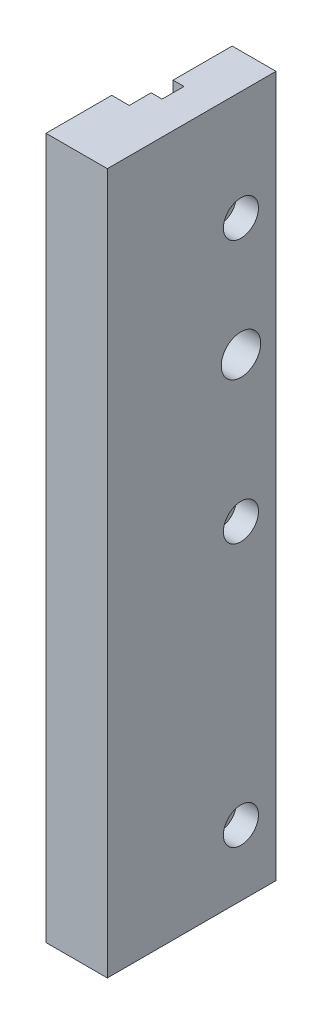
ISO-10303-21;
HEADER;
FILE_DESCRIPTION(('STEP AP214'),'2;1');
FILE_NAME('part.step','',(''),(''),'','','');
FILE_SCHEMA(('AUTOMOTIVE_DESIGN { 1 0 10303 214 1 1 1 1 }'));
ENDSEC;
DATA;
#1=APPLICATION_CONTEXT('core data for automotive mechanical design processes');
#2=APPLICATION_PROTOCOL_DEFINITION('international standard','automotive_design',2000,#1);
#3=PRODUCT_CONTEXT('',#1,'mechanical');
#4=PRODUCT('Part','Part','',(#3));
#5=PRODUCT_RELATED_PRODUCT_CATEGORY('part','',(#4));
#6=PRODUCT_DEFINITION_FORMATION('','',#4);
#7=PRODUCT_DEFINITION_CONTEXT('part definition',#1,'design');
#8=PRODUCT_DEFINITION('design','',#6,#7);
#9=PRODUCT_DEFINITION_SHAPE('','',#8);
#10=(LENGTH_UNIT() NAMED_UNIT(*) SI_UNIT(.MILLI.,.METRE.));
#11=(NAMED_UNIT(*) PLANE_ANGLE_UNIT() SI_UNIT($,.RADIAN.));
#12=(NAMED_UNIT(*) SI_UNIT($,.STERADIAN.) SOLID_ANGLE_UNIT());
#13=UNCERTAINTY_MEASURE_WITH_UNIT(LENGTH_MEASURE(1.E-05),#10,'distance_accuracy_value','');
#14=(GEOMETRIC_REPRESENTATION_CONTEXT(3) GLOBAL_UNCERTAINTY_ASSIGNED_CONTEXT((#13)) GLOBAL_UNIT_ASSIGNED_CONTEXT((#10,
#11,#12)) REPRESENTATION_CONTEXT('',''));
#15=CARTESIAN_POINT('',(0.,0.,0.));
#16=DIRECTION('',(0.,0.,1.));
#17=DIRECTION('',(1.,0.,0.));
#18=AXIS2_PLACEMENT_3D('',#15,#16,#17);
#19=CARTESIAN_POINT('',(10.,160.,0.));
#20=DIRECTION('',(0.,0.,-1.));
#21=DIRECTION('',(-1.,0.,0.));
#22=AXIS2_PLACEMENT_3D('',#19,#20,#21);
#23=PLANE('',#22);
#24=DIRECTION('',(1.,0.,0.));
#25=VECTOR('',#24,1.);
#26=CARTESIAN_POINT('',(10.,0.,0.));
#27=LINE('',#26,#25);
#28=CARTESIAN_POINT('',(-4.,0.,0.));
#29=VERTEX_POINT('',#28);
#30=CARTESIAN_POINT('',(10.,0.,0.));
#31=VERTEX_POINT('',#30);
#32=EDGE_CURVE('E99',#29,#31,#27,.T.);
#33=ORIENTED_EDGE('',*,*,#32,.T.);
#34=DIRECTION('',(0.,-1.,0.));
#35=VECTOR('',#34,1.);
#36=CARTESIAN_POINT('',(10.,160.,0.));
#37=LINE('',#36,#35);
#38=CARTESIAN_POINT('',(10.,160.,0.));
#39=VERTEX_POINT('',#38);
#40=EDGE_CURVE('E11',#39,#31,#37,.T.);
#41=ORIENTED_EDGE('',*,*,#40,.F.);
#42=DIRECTION('',(1.,0.,0.));
#43=VECTOR('',#42,1.);
#44=CARTESIAN_POINT('',(-4.,160.,0.));
#45=LINE('',#44,#43);
#46=CARTESIAN_POINT('',(-4.,160.,0.));
#47=VERTEX_POINT('',#46);
#48=EDGE_CURVE('E105',#47,#39,#45,.T.);
#49=ORIENTED_EDGE('',*,*,#48,.F.);
#50=DIRECTION('',(0.,-1.,0.));
#51=VECTOR('',#50,1.);
#52=CARTESIAN_POINT('',(-4.,160.,0.));
#53=LINE('',#52,#51);
#54=EDGE_CURVE('E145',#47,#29,#53,.T.);
#55=ORIENTED_EDGE('',*,*,#54,.T.);
#56=EDGE_LOOP('',(#33,#41,#49,#55));
#57=FACE_BOUND('',#56,.T.);
#58=ADVANCED_FACE('F39',(#57),#23,.F.);
#59=CARTESIAN_POINT('',(10.,160.,-38.5));
#60=DIRECTION('',(-1.,0.,0.));
#61=DIRECTION('',(0.,0.,1.));
#62=AXIS2_PLACEMENT_3D('',#59,#60,#61);
#63=PLANE('',#62);
#64=CARTESIAN_POINT('',(10.,15.,-30.5));
#65=DIRECTION('',(1.,0.,0.));
#66=DIRECTION('',(0.,0.,-1.));
#67=AXIS2_PLACEMENT_3D('',#64,#65,#66);
#68=CIRCLE('',#67,4.00000000000001);
#69=CARTESIAN_POINT('',(10.,15.,-34.5));
#70=VERTEX_POINT('',#69);
#71=EDGE_CURVE('E209',#70,#70,#68,.T.);
#72=ORIENTED_EDGE('',*,*,#71,.F.);
#73=EDGE_LOOP('',(#72));
#74=FACE_BOUND('',#73,.T.);
#75=CARTESIAN_POINT('',(10.,108.,-30.5));
#76=DIRECTION('',(1.,0.,0.));
#77=DIRECTION('',(0.,0.,-1.));
#78=AXIS2_PLACEMENT_3D('',#75,#76,#77);
#79=CIRCLE('',#78,4.5);
#80=CARTESIAN_POINT('',(10.,108.,-35.));
#81=VERTEX_POINT('',#80);
#82=EDGE_CURVE('E196',#81,#81,#79,.T.);
#83=ORIENTED_EDGE('',*,*,#82,.F.);
#84=EDGE_LOOP('',(#83));
#85=FACE_BOUND('',#84,.T.);
#86=CARTESIAN_POINT('',(10.,75.,-30.5));
#87=DIRECTION('',(1.,0.,0.));
#88=DIRECTION('',(0.,0.,-1.));
#89=AXIS2_PLACEMENT_3D('',#86,#87,#88);
#90=CIRCLE('',#89,4.00000000000001);
#91=CARTESIAN_POINT('',(10.,75.,-34.5));
#92=VERTEX_POINT('',#91);
#93=EDGE_CURVE('E205',#92,#92,#90,.T.);
#94=ORIENTED_EDGE('',*,*,#93,.F.);
#95=EDGE_LOOP('',(#94));
#96=FACE_BOUND('',#95,.T.);
#97=CARTESIAN_POINT('',(10.,135.,-30.5));
#98=DIRECTION('',(1.,0.,0.));
#99=DIRECTION('',(0.,0.,-1.));
#100=AXIS2_PLACEMENT_3D('',#97,#98,#99);
#101=CIRCLE('',#100,4.00000000000001);
#102=CARTESIAN_POINT('',(10.,135.,-34.5));
#103=VERTEX_POINT('',#102);
#104=EDGE_CURVE('E211',#103,#103,#101,.T.);
#105=ORIENTED_EDGE('',*,*,#104,.F.);
#106=EDGE_LOOP('',(#105));
#107=FACE_BOUND('',#106,.T.);
#108=DIRECTION('',(0.,0.,-1.));
#109=VECTOR('',#108,1.);
#110=CARTESIAN_POINT('',(10.,0.,-38.5));
#111=LINE('',#110,#109);
#112=CARTESIAN_POINT('',(10.,0.,-38.5));
#113=VERTEX_POINT('',#112);
#114=EDGE_CURVE('E150',#31,#113,#111,.T.);
#115=ORIENTED_EDGE('',*,*,#114,.T.);
#116=DIRECTION('',(0.,-1.,0.));
#117=VECTOR('',#116,1.);
#118=CARTESIAN_POINT('',(10.,160.,-38.5));
#119=LINE('',#118,#117);
#120=CARTESIAN_POINT('',(10.,160.,-38.5));
#121=VERTEX_POINT('',#120);
#122=EDGE_CURVE('E48',#121,#113,#119,.T.);
#123=ORIENTED_EDGE('',*,*,#122,.F.);
#124=DIRECTION('',(0.,0.,-1.));
#125=VECTOR('',#124,1.);
#126=CARTESIAN_POINT('',(10.,160.,-38.5));
#127=LINE('',#126,#125);
#128=EDGE_CURVE('E220',#39,#121,#127,.T.);
#129=ORIENTED_EDGE('',*,*,#128,.F.);
#130=ORIENTED_EDGE('',*,*,#40,.T.);
#131=EDGE_LOOP('',(#115,#123,#129,#130));
#132=FACE_BOUND('',#131,.T.);
#133=ADVANCED_FACE('F246',(#74,#85,#96,#107,#132),#63,.F.);
#134=CARTESIAN_POINT('',(0.,160.,-38.5));
#135=DIRECTION('',(0.,0.,1.));
#136=DIRECTION('',(1.,0.,0.));
#137=AXIS2_PLACEMENT_3D('',#134,#135,#136);
#138=PLANE('',#137);
#139=DIRECTION('',(-1.,0.,0.));
#140=VECTOR('',#139,1.);
#141=CARTESIAN_POINT('',(0.,0.,-38.5));
#142=LINE('',#141,#140);
#143=CARTESIAN_POINT('',(0.,0.,-38.5));
#144=VERTEX_POINT('',#143);
#145=EDGE_CURVE('E153',#113,#144,#142,.T.);
#146=ORIENTED_EDGE('',*,*,#145,.T.);
#147=DIRECTION('',(0.,-1.,0.));
#148=VECTOR('',#147,1.);
#149=CARTESIAN_POINT('',(0.,160.,-38.5));
#150=LINE('',#149,#148);
#151=CARTESIAN_POINT('',(0.,160.,-38.5));
#152=VERTEX_POINT('',#151);
#153=EDGE_CURVE('E180',#152,#144,#150,.T.);
#154=ORIENTED_EDGE('',*,*,#153,.F.);
#155=DIRECTION('',(-1.,0.,0.));
#156=VECTOR('',#155,1.);
#157=CARTESIAN_POINT('',(0.,160.,-38.5));
#158=LINE('',#157,#156);
#159=EDGE_CURVE('E222',#121,#152,#158,.T.);
#160=ORIENTED_EDGE('',*,*,#159,.F.);
#161=ORIENTED_EDGE('',*,*,#122,.T.);
#162=EDGE_LOOP('',(#146,#154,#160,#161));
#163=FACE_BOUND('',#162,.T.);
#164=ADVANCED_FACE('F252',(#163),#138,.F.);
#165=CARTESIAN_POINT('',(0.,160.,-25.));
#166=DIRECTION('',(1.,0.,0.));
#167=DIRECTION('',(0.,0.,-1.));
#168=AXIS2_PLACEMENT_3D('',#165,#166,#167);
#169=PLANE('',#168);
#170=CARTESIAN_POINT('',(0.,15.,-30.5));
#171=DIRECTION('',(1.,0.,0.));
#172=DIRECTION('',(0.,0.,-1.));
#173=AXIS2_PLACEMENT_3D('',#170,#171,#172);
#174=CIRCLE('',#173,2.5);
#175=CARTESIAN_POINT('',(0.,15.,-33.));
#176=VERTEX_POINT('',#175);
#177=EDGE_CURVE('E42',#176,#176,#174,.T.);
#178=ORIENTED_EDGE('',*,*,#177,.T.);
#179=EDGE_LOOP('',(#178));
#180=FACE_BOUND('',#179,.T.);
#181=CARTESIAN_POINT('',(0.,108.,-30.5));
#182=DIRECTION('',(1.,0.,0.));
#183=DIRECTION('',(0.,0.,-1.));
#184=AXIS2_PLACEMENT_3D('',#181,#182,#183);
#185=CIRCLE('',#184,4.5);
#186=CARTESIAN_POINT('',(0.,108.,-35.));
#187=VERTEX_POINT('',#186);
#188=EDGE_CURVE('E191',#187,#187,#185,.T.);
#189=ORIENTED_EDGE('',*,*,#188,.T.);
#190=EDGE_LOOP('',(#189));
#191=FACE_BOUND('',#190,.T.);
#192=CARTESIAN_POINT('',(0.,75.,-30.5));
#193=DIRECTION('',(1.,0.,0.));
#194=DIRECTION('',(0.,0.,-1.));
#195=AXIS2_PLACEMENT_3D('',#192,#193,#194);
#196=CIRCLE('',#195,2.5);
#197=CARTESIAN_POINT('',(0.,75.,-33.));
#198=VERTEX_POINT('',#197);
#199=EDGE_CURVE('E188',#198,#198,#196,.T.);
#200=ORIENTED_EDGE('',*,*,#199,.T.);
#201=EDGE_LOOP('',(#200));
#202=FACE_BOUND('',#201,.T.);
#203=CARTESIAN_POINT('',(0.,135.,-30.5));
#204=DIRECTION('',(1.,0.,0.));
#205=DIRECTION('',(0.,0.,-1.));
#206=AXIS2_PLACEMENT_3D('',#203,#204,#205);
#207=CIRCLE('',#206,2.5);
#208=CARTESIAN_POINT('',(0.,135.,-33.));
#209=VERTEX_POINT('',#208);
#210=EDGE_CURVE('E185',#209,#209,#207,.T.);
#211=ORIENTED_EDGE('',*,*,#210,.T.);
#212=EDGE_LOOP('',(#211));
#213=FACE_BOUND('',#212,.T.);
#214=DIRECTION('',(0.,0.,1.));
#215=VECTOR('',#214,1.);
#216=CARTESIAN_POINT('',(0.,0.,-25.));
#217=LINE('',#216,#215);
#218=CARTESIAN_POINT('',(0.,0.,-25.));
#219=VERTEX_POINT('',#218);
#220=EDGE_CURVE('E155',#144,#219,#217,.T.);
#221=ORIENTED_EDGE('',*,*,#220,.T.);
#222=DIRECTION('',(0.,-1.,0.));
#223=VECTOR('',#222,1.);
#224=CARTESIAN_POINT('',(0.,160.,-25.));
#225=LINE('',#224,#223);
#226=CARTESIAN_POINT('',(0.,160.,-25.));
#227=VERTEX_POINT('',#226);
#228=EDGE_CURVE('E177',#227,#219,#225,.T.);
#229=ORIENTED_EDGE('',*,*,#228,.F.);
#230=DIRECTION('',(0.,0.,1.));
#231=VECTOR('',#230,1.);
#232=CARTESIAN_POINT('',(0.,160.,-25.));
#233=LINE('',#232,#231);
#234=EDGE_CURVE('E224',#152,#227,#233,.T.);
#235=ORIENTED_EDGE('',*,*,#234,.F.);
#236=ORIENTED_EDGE('',*,*,#153,.T.);
#237=EDGE_LOOP('',(#221,#229,#235,#236));
#238=FACE_BOUND('',#237,.T.);
#239=ADVANCED_FACE('F256',(#180,#191,#202,#213,#238),#169,.F.);
#240=CARTESIAN_POINT('',(2.5,160.,-25.));
#241=DIRECTION('',(0.,0.,-1.));
#242=DIRECTION('',(-1.,0.,0.));
#243=AXIS2_PLACEMENT_3D('',#240,#241,#242);
#244=PLANE('',#243);
#245=DIRECTION('',(1.,0.,0.));
#246=VECTOR('',#245,1.);
#247=CARTESIAN_POINT('',(2.5,0.,-25.));
#248=LINE('',#247,#246);
#249=CARTESIAN_POINT('',(2.5,0.,-25.));
#250=VERTEX_POINT('',#249);
#251=EDGE_CURVE('E157',#219,#250,#248,.T.);
#252=ORIENTED_EDGE('',*,*,#251,.T.);
#253=DIRECTION('',(0.,-1.,0.));
#254=VECTOR('',#253,1.);
#255=CARTESIAN_POINT('',(2.5,160.,-25.));
#256=LINE('',#255,#254);
#257=CARTESIAN_POINT('',(2.5,160.,-25.));
#258=VERTEX_POINT('',#257);
#259=EDGE_CURVE('E174',#258,#250,#256,.T.);
#260=ORIENTED_EDGE('',*,*,#259,.F.);
#261=DIRECTION('',(1.,0.,0.));
#262=VECTOR('',#261,1.);
#263=CARTESIAN_POINT('',(2.5,160.,-25.));
#264=LINE('',#263,#262);
#265=EDGE_CURVE('E226',#227,#258,#264,.T.);
#266=ORIENTED_EDGE('',*,*,#265,.F.);
#267=ORIENTED_EDGE('',*,*,#228,.T.);
#268=EDGE_LOOP('',(#252,#260,#266,#267));
#269=FACE_BOUND('',#268,.T.);
#270=ADVANCED_FACE('F259',(#269),#244,.F.);
#271=CARTESIAN_POINT('',(2.5,160.,-20.));
#272=DIRECTION('',(1.,0.,0.));
#273=DIRECTION('',(0.,0.,-1.));
#274=AXIS2_PLACEMENT_3D('',#271,#272,#273);
#275=PLANE('',#274);
#276=DIRECTION('',(0.,0.,1.));
#277=VECTOR('',#276,1.);
#278=CARTESIAN_POINT('',(2.5,0.,-20.));
#279=LINE('',#278,#277);
#280=CARTESIAN_POINT('',(2.5,0.,-20.));
#281=VERTEX_POINT('',#280);
#282=EDGE_CURVE('E159',#250,#281,#279,.T.);
#283=ORIENTED_EDGE('',*,*,#282,.T.);
#284=DIRECTION('',(0.,-1.,0.));
#285=VECTOR('',#284,1.);
#286=CARTESIAN_POINT('',(2.5,160.,-20.));
#287=LINE('',#286,#285);
#288=CARTESIAN_POINT('',(2.5,160.,-20.));
#289=VERTEX_POINT('',#288);
#290=EDGE_CURVE('E171',#289,#281,#287,.T.);
#291=ORIENTED_EDGE('',*,*,#290,.F.);
#292=DIRECTION('',(0.,0.,1.));
#293=VECTOR('',#292,1.);
#294=CARTESIAN_POINT('',(2.5,160.,-20.));
#295=LINE('',#294,#293);
#296=EDGE_CURVE('E228',#258,#289,#295,.T.);
#297=ORIENTED_EDGE('',*,*,#296,.F.);
#298=ORIENTED_EDGE('',*,*,#259,.T.);
#299=EDGE_LOOP('',(#283,#291,#297,#298));
#300=FACE_BOUND('',#299,.T.);
#301=ADVANCED_FACE('F234',(#300),#275,.F.);
#302=CARTESIAN_POINT('',(0.,160.,-20.));
#303=DIRECTION('',(0.,0.,1.));
#304=DIRECTION('',(1.,0.,0.));
#305=AXIS2_PLACEMENT_3D('',#302,#303,#304);
#306=PLANE('',#305);
#307=DIRECTION('',(-1.,0.,0.));
#308=VECTOR('',#307,1.);
#309=CARTESIAN_POINT('',(0.,0.,-20.));
#310=LINE('',#309,#308);
#311=CARTESIAN_POINT('',(0.,0.,-20.));
#312=VERTEX_POINT('',#311);
#313=EDGE_CURVE('E161',#281,#312,#310,.T.);
#314=ORIENTED_EDGE('',*,*,#313,.T.);
#315=DIRECTION('',(0.,-1.,0.));
#316=VECTOR('',#315,1.);
#317=CARTESIAN_POINT('',(0.,160.,-20.));
#318=LINE('',#317,#316);
#319=CARTESIAN_POINT('',(0.,160.,-20.));
#320=VERTEX_POINT('',#319);
#321=EDGE_CURVE('E140',#320,#312,#318,.T.);
#322=ORIENTED_EDGE('',*,*,#321,.F.);
#323=DIRECTION('',(-1.,0.,0.));
#324=VECTOR('',#323,1.);
#325=CARTESIAN_POINT('',(0.,160.,-20.));
#326=LINE('',#325,#324);
#327=EDGE_CURVE('E131',#289,#320,#326,.T.);
#328=ORIENTED_EDGE('',*,*,#327,.F.);
#329=ORIENTED_EDGE('',*,*,#290,.T.);
#330=EDGE_LOOP('',(#314,#322,#328,#329));
#331=FACE_BOUND('',#330,.T.);
#332=ADVANCED_FACE('F238',(#331),#306,.F.);
#333=CARTESIAN_POINT('',(0.,160.,-20.));
#334=DIRECTION('',(1.,0.,0.));
#335=DIRECTION('',(0.,0.,-1.));
#336=AXIS2_PLACEMENT_3D('',#333,#334,#335);
#337=PLANE('',#336);
#338=DIRECTION('',(0.,0.,1.));
#339=VECTOR('',#338,1.);
#340=CARTESIAN_POINT('',(0.,0.,-20.));
#341=LINE('',#340,#339);
#342=CARTESIAN_POINT('',(0.,0.,-15.));
#343=VERTEX_POINT('',#342);
#344=EDGE_CURVE('E139',#312,#343,#341,.T.);
#345=ORIENTED_EDGE('',*,*,#344,.T.);
#346=DIRECTION('',(0.,-1.,0.));
#347=VECTOR('',#346,1.);
#348=CARTESIAN_POINT('',(0.,160.,-15.));
#349=LINE('',#348,#347);
#350=CARTESIAN_POINT('',(0.,160.,-15.));
#351=VERTEX_POINT('',#350);
#352=EDGE_CURVE('E136',#351,#343,#349,.T.);
#353=ORIENTED_EDGE('',*,*,#352,.F.);
#354=DIRECTION('',(0.,0.,1.));
#355=VECTOR('',#354,1.);
#356=CARTESIAN_POINT('',(0.,160.,-20.));
#357=LINE('',#356,#355);
#358=EDGE_CURVE('E125',#320,#351,#357,.T.);
#359=ORIENTED_EDGE('',*,*,#358,.F.);
#360=ORIENTED_EDGE('',*,*,#321,.T.);
#361=EDGE_LOOP('',(#345,#353,#359,#360));
#362=FACE_BOUND('',#361,.T.);
#363=ADVANCED_FACE('F137',(#362),#337,.F.);
#364=CARTESIAN_POINT('',(0.,160.,-15.));
#365=DIRECTION('',(0.,0.,1.));
#366=DIRECTION('',(1.,0.,0.));
#367=AXIS2_PLACEMENT_3D('',#364,#365,#366);
#368=PLANE('',#367);
#369=DIRECTION('',(-1.,0.,0.));
#370=VECTOR('',#369,1.);
#371=CARTESIAN_POINT('',(0.,0.,-15.));
#372=LINE('',#371,#370);
#373=CARTESIAN_POINT('',(-4.,0.,-15.));
#374=VERTEX_POINT('',#373);
#375=EDGE_CURVE('E92',#343,#374,#372,.T.);
#376=ORIENTED_EDGE('',*,*,#375,.T.);
#377=DIRECTION('',(0.,-1.,0.));
#378=VECTOR('',#377,1.);
#379=CARTESIAN_POINT('',(-4.,160.,-15.));
#380=LINE('',#379,#378);
#381=CARTESIAN_POINT('',(-4.,160.,-15.));
#382=VERTEX_POINT('',#381);
#383=EDGE_CURVE('E141',#382,#374,#380,.T.);
#384=ORIENTED_EDGE('',*,*,#383,.F.);
#385=DIRECTION('',(-1.,0.,0.));
#386=VECTOR('',#385,1.);
#387=CARTESIAN_POINT('',(0.,160.,-15.));
#388=LINE('',#387,#386);
#389=EDGE_CURVE('E129',#351,#382,#388,.T.);
#390=ORIENTED_EDGE('',*,*,#389,.F.);
#391=ORIENTED_EDGE('',*,*,#352,.T.);
#392=EDGE_LOOP('',(#376,#384,#390,#391));
#393=FACE_BOUND('',#392,.T.);
#394=ADVANCED_FACE('F143',(#393),#368,.F.);
#395=CARTESIAN_POINT('',(-4.,160.,-15.));
#396=DIRECTION('',(1.,0.,0.));
#397=DIRECTION('',(0.,0.,-1.));
#398=AXIS2_PLACEMENT_3D('',#395,#396,#397);
#399=PLANE('',#398);
#400=DIRECTION('',(0.,0.,1.));
#401=VECTOR('',#400,1.);
#402=CARTESIAN_POINT('',(-4.,0.,-15.));
#403=LINE('',#402,#401);
#404=EDGE_CURVE('E165',#374,#29,#403,.T.);
#405=ORIENTED_EDGE('',*,*,#404,.T.);
#406=ORIENTED_EDGE('',*,*,#54,.F.);
#407=DIRECTION('',(0.,0.,1.));
#408=VECTOR('',#407,1.);
#409=CARTESIAN_POINT('',(-4.,160.,-15.));
#410=LINE('',#409,#408);
#411=EDGE_CURVE('E57',#382,#47,#410,.T.);
#412=ORIENTED_EDGE('',*,*,#411,.F.);
#413=ORIENTED_EDGE('',*,*,#383,.T.);
#414=EDGE_LOOP('',(#405,#406,#412,#413));
#415=FACE_BOUND('',#414,.T.);
#416=ADVANCED_FACE('F241',(#415),#399,.F.);
#417=CARTESIAN_POINT('',(0.,160.,0.));
#418=DIRECTION('',(0.,-1.,0.));
#419=DIRECTION('',(0.,0.,-1.));
#420=AXIS2_PLACEMENT_3D('',#417,#418,#419);
#421=PLANE('',#420);
#422=ORIENTED_EDGE('',*,*,#48,.T.);
#423=ORIENTED_EDGE('',*,*,#128,.T.);
#424=ORIENTED_EDGE('',*,*,#159,.T.);
#425=ORIENTED_EDGE('',*,*,#234,.T.);
#426=ORIENTED_EDGE('',*,*,#265,.T.);
#427=ORIENTED_EDGE('',*,*,#296,.T.);
#428=ORIENTED_EDGE('',*,*,#327,.T.);
#429=ORIENTED_EDGE('',*,*,#358,.T.);
#430=ORIENTED_EDGE('',*,*,#389,.T.);
#431=ORIENTED_EDGE('',*,*,#411,.T.);
#432=EDGE_LOOP('',(#422,#423,#424,#425,#426,#427,#428,#429,#430,#431));
#433=FACE_BOUND('',#432,.T.);
#434=ADVANCED_FACE('F127',(#433),#421,.F.);
#435=CARTESIAN_POINT('',(0.,0.,0.));
#436=DIRECTION('',(0.,-1.,0.));
#437=DIRECTION('',(0.,0.,-1.));
#438=AXIS2_PLACEMENT_3D('',#435,#436,#437);
#439=PLANE('',#438);
#440=ORIENTED_EDGE('',*,*,#32,.F.);
#441=ORIENTED_EDGE('',*,*,#404,.F.);
#442=ORIENTED_EDGE('',*,*,#375,.F.);
#443=ORIENTED_EDGE('',*,*,#344,.F.);
#444=ORIENTED_EDGE('',*,*,#313,.F.);
#445=ORIENTED_EDGE('',*,*,#282,.F.);
#446=ORIENTED_EDGE('',*,*,#251,.F.);
#447=ORIENTED_EDGE('',*,*,#220,.F.);
#448=ORIENTED_EDGE('',*,*,#145,.F.);
#449=ORIENTED_EDGE('',*,*,#114,.F.);
#450=EDGE_LOOP('',(#440,#441,#442,#443,#444,#445,#446,#447,#448,#449));
#451=FACE_BOUND('',#450,.T.);
#452=ADVANCED_FACE('F239',(#451),#439,.T.);
#453=CARTESIAN_POINT('',(5.,135.,-30.5));
#454=DIRECTION('',(1.,0.,0.));
#455=DIRECTION('',(0.,0.,-1.));
#456=AXIS2_PLACEMENT_3D('',#453,#454,#455);
#457=CYLINDRICAL_SURFACE('',#456,4.00000000000001);
#458=CARTESIAN_POINT('',(5.,135.,-30.5));
#459=DIRECTION('',(1.,0.,0.));
#460=DIRECTION('',(0.,0.,-1.));
#461=AXIS2_PLACEMENT_3D('',#458,#459,#460);
#462=CIRCLE('',#461,4.00000000000001);
#463=CARTESIAN_POINT('',(5.,135.,-34.5));
#464=VERTEX_POINT('',#463);
#465=EDGE_CURVE('E214',#464,#464,#462,.T.);
#466=ORIENTED_EDGE('',*,*,#465,.F.);
#467=EDGE_LOOP('',(#466));
#468=FACE_BOUND('',#467,.T.);
#469=ORIENTED_EDGE('',*,*,#104,.T.);
#470=EDGE_LOOP('',(#469));
#471=FACE_BOUND('',#470,.T.);
#472=ADVANCED_FACE('F285',(#468,#471),#457,.F.);
#473=CARTESIAN_POINT('',(5.,135.,-30.5));
#474=DIRECTION('',(1.,0.,0.));
#475=DIRECTION('',(0.,0.,-1.));
#476=AXIS2_PLACEMENT_3D('',#473,#474,#475);
#477=PLANE('',#476);
#478=CARTESIAN_POINT('',(5.,135.,-30.5));
#479=DIRECTION('',(1.,0.,0.));
#480=DIRECTION('',(0.,0.,-1.));
#481=AXIS2_PLACEMENT_3D('',#478,#479,#480);
#482=CIRCLE('',#481,2.5);
#483=CARTESIAN_POINT('',(5.,135.,-33.));
#484=VERTEX_POINT('',#483);
#485=EDGE_CURVE('E516',#484,#484,#482,.T.);
#486=ORIENTED_EDGE('',*,*,#485,.F.);
#487=EDGE_LOOP('',(#486));
#488=FACE_BOUND('',#487,.T.);
#489=ORIENTED_EDGE('',*,*,#465,.T.);
#490=EDGE_LOOP('',(#489));
#491=FACE_BOUND('',#490,.T.);
#492=ADVANCED_FACE('F287',(#488,#491),#477,.T.);
#493=CARTESIAN_POINT('',(5.,75.,-30.5));
#494=DIRECTION('',(1.,0.,0.));
#495=DIRECTION('',(0.,0.,-1.));
#496=AXIS2_PLACEMENT_3D('',#493,#494,#495);
#497=CYLINDRICAL_SURFACE('',#496,4.00000000000001);
#498=CARTESIAN_POINT('',(5.,75.,-30.5));
#499=DIRECTION('',(1.,0.,0.));
#500=DIRECTION('',(0.,0.,-1.));
#501=AXIS2_PLACEMENT_3D('',#498,#499,#500);
#502=CIRCLE('',#501,4.00000000000001);
#503=CARTESIAN_POINT('',(5.,75.,-34.5));
#504=VERTEX_POINT('',#503);
#505=EDGE_CURVE('E200',#504,#504,#502,.T.);
#506=ORIENTED_EDGE('',*,*,#505,.F.);
#507=EDGE_LOOP('',(#506));
#508=FACE_BOUND('',#507,.T.);
#509=ORIENTED_EDGE('',*,*,#93,.T.);
#510=EDGE_LOOP('',(#509));
#511=FACE_BOUND('',#510,.T.);
#512=ADVANCED_FACE('F294',(#508,#511),#497,.F.);
#513=CARTESIAN_POINT('',(5.,75.,-30.5));
#514=DIRECTION('',(1.,0.,0.));
#515=DIRECTION('',(0.,0.,-1.));
#516=AXIS2_PLACEMENT_3D('',#513,#514,#515);
#517=PLANE('',#516);
#518=CARTESIAN_POINT('',(5.,75.,-30.5));
#519=DIRECTION('',(1.,0.,0.));
#520=DIRECTION('',(0.,0.,-1.));
#521=AXIS2_PLACEMENT_3D('',#518,#519,#520);
#522=CIRCLE('',#521,2.5);
#523=CARTESIAN_POINT('',(5.,75.,-33.));
#524=VERTEX_POINT('',#523);
#525=EDGE_CURVE('E519',#524,#524,#522,.T.);
#526=ORIENTED_EDGE('',*,*,#525,.F.);
#527=EDGE_LOOP('',(#526));
#528=FACE_BOUND('',#527,.T.);
#529=ORIENTED_EDGE('',*,*,#505,.T.);
#530=EDGE_LOOP('',(#529));
#531=FACE_BOUND('',#530,.T.);
#532=ADVANCED_FACE('F305',(#528,#531),#517,.T.);
#533=CARTESIAN_POINT('',(5.,108.,-30.5));
#534=DIRECTION('',(1.,0.,0.));
#535=DIRECTION('',(0.,0.,-1.));
#536=AXIS2_PLACEMENT_3D('',#533,#534,#535);
#537=CYLINDRICAL_SURFACE('',#536,4.5);
#538=ORIENTED_EDGE('',*,*,#82,.T.);
#539=EDGE_LOOP('',(#538));
#540=FACE_BOUND('',#539,.T.);
#541=ORIENTED_EDGE('',*,*,#188,.F.);
#542=EDGE_LOOP('',(#541));
#543=FACE_BOUND('',#542,.T.);
#544=ADVANCED_FACE('F300',(#540,#543),#537,.F.);
#545=CARTESIAN_POINT('',(5.,15.,-30.5));
#546=DIRECTION('',(1.,0.,0.));
#547=DIRECTION('',(0.,0.,-1.));
#548=AXIS2_PLACEMENT_3D('',#545,#546,#547);
#549=CYLINDRICAL_SURFACE('',#548,4.00000000000001);
#550=CARTESIAN_POINT('',(5.,15.,-30.5));
#551=DIRECTION('',(1.,0.,0.));
#552=DIRECTION('',(0.,0.,-1.));
#553=AXIS2_PLACEMENT_3D('',#550,#551,#552);
#554=CIRCLE('',#553,4.00000000000001);
#555=CARTESIAN_POINT('',(5.,15.,-34.5));
#556=VERTEX_POINT('',#555);
#557=EDGE_CURVE('E151',#556,#556,#554,.T.);
#558=ORIENTED_EDGE('',*,*,#557,.F.);
#559=EDGE_LOOP('',(#558));
#560=FACE_BOUND('',#559,.T.);
#561=ORIENTED_EDGE('',*,*,#71,.T.);
#562=EDGE_LOOP('',(#561));
#563=FACE_BOUND('',#562,.T.);
#564=ADVANCED_FACE('F370',(#560,#563),#549,.F.);
#565=CARTESIAN_POINT('',(5.,15.,-30.5));
#566=DIRECTION('',(1.,0.,0.));
#567=DIRECTION('',(0.,0.,-1.));
#568=AXIS2_PLACEMENT_3D('',#565,#566,#567);
#569=PLANE('',#568);
#570=CARTESIAN_POINT('',(5.,15.,-30.5));
#571=DIRECTION('',(1.,0.,0.));
#572=DIRECTION('',(0.,0.,-1.));
#573=AXIS2_PLACEMENT_3D('',#570,#571,#572);
#574=CIRCLE('',#573,2.5);
#575=CARTESIAN_POINT('',(5.,15.,-33.));
#576=VERTEX_POINT('',#575);
#577=EDGE_CURVE('E189',#576,#576,#574,.T.);
#578=ORIENTED_EDGE('',*,*,#577,.F.);
#579=EDGE_LOOP('',(#578));
#580=FACE_BOUND('',#579,.T.);
#581=ORIENTED_EDGE('',*,*,#557,.T.);
#582=EDGE_LOOP('',(#581));
#583=FACE_BOUND('',#582,.T.);
#584=ADVANCED_FACE('F375',(#580,#583),#569,.T.);
#585=CARTESIAN_POINT('',(-4.00000000000001,135.,-30.5));
#586=DIRECTION('',(1.,0.,0.));
#587=DIRECTION('',(0.,0.,-1.));
#588=AXIS2_PLACEMENT_3D('',#585,#586,#587);
#589=CYLINDRICAL_SURFACE('',#588,2.5);
#590=ORIENTED_EDGE('',*,*,#485,.T.);
#591=EDGE_LOOP('',(#590));
#592=FACE_BOUND('',#591,.T.);
#593=ORIENTED_EDGE('',*,*,#210,.F.);
#594=EDGE_LOOP('',(#593));
#595=FACE_BOUND('',#594,.T.);
#596=ADVANCED_FACE('F414',(#592,#595),#589,.F.);
#597=CARTESIAN_POINT('',(-4.00000000000001,75.,-30.5));
#598=DIRECTION('',(1.,0.,0.));
#599=DIRECTION('',(0.,0.,-1.));
#600=AXIS2_PLACEMENT_3D('',#597,#598,#599);
#601=CYLINDRICAL_SURFACE('',#600,2.5);
#602=ORIENTED_EDGE('',*,*,#525,.T.);
#603=EDGE_LOOP('',(#602));
#604=FACE_BOUND('',#603,.T.);
#605=ORIENTED_EDGE('',*,*,#199,.F.);
#606=EDGE_LOOP('',(#605));
#607=FACE_BOUND('',#606,.T.);
#608=ADVANCED_FACE('F424',(#604,#607),#601,.F.);
#609=CARTESIAN_POINT('',(-4.00000000000001,15.,-30.5));
#610=DIRECTION('',(1.,0.,0.));
#611=DIRECTION('',(0.,0.,-1.));
#612=AXIS2_PLACEMENT_3D('',#609,#610,#611);
#613=CYLINDRICAL_SURFACE('',#612,2.5);
#614=ORIENTED_EDGE('',*,*,#577,.T.);
#615=EDGE_LOOP('',(#614));
#616=FACE_BOUND('',#615,.T.);
#617=ORIENTED_EDGE('',*,*,#177,.F.);
#618=EDGE_LOOP('',(#617));
#619=FACE_BOUND('',#618,.T.);
#620=ADVANCED_FACE('F435',(#616,#619),#613,.F.);
#621=CLOSED_SHELL('',(#58,#133,#164,#239,#270,#301,#332,#363,#394,#416,#434,#452,#472,#492,#512,
#532,#544,#564,#584,#596,#608,#620));
#622=MANIFOLD_SOLID_BREP('B2',#621);
#623=ADVANCED_BREP_SHAPE_REPRESENTATION('',(#18,#622),#14);
#624=SHAPE_DEFINITION_REPRESENTATION(#9,#623);
ENDSEC;
END-ISO-10303-21;
